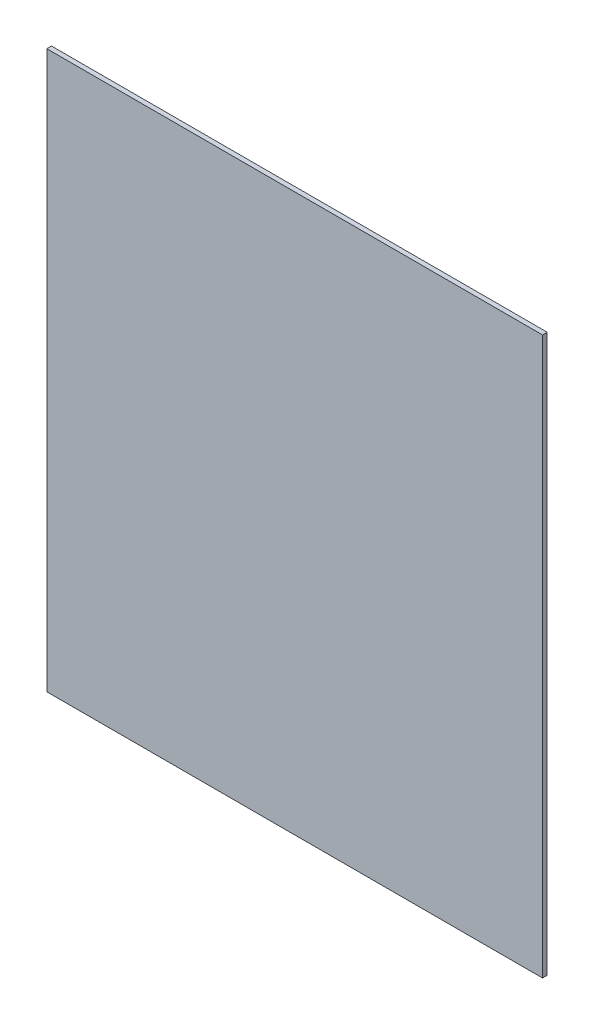
ISO-10303-21;
HEADER;
FILE_DESCRIPTION(('STEP AP214'),'2;1');
FILE_NAME('part.step','',(''),(''),'','','');
FILE_SCHEMA(('AUTOMOTIVE_DESIGN { 1 0 10303 214 1 1 1 1 }'));
ENDSEC;
DATA;
#1=APPLICATION_CONTEXT('core data for automotive mechanical design processes');
#2=APPLICATION_PROTOCOL_DEFINITION('international standard','automotive_design',2000,#1);
#3=PRODUCT_CONTEXT('',#1,'mechanical');
#4=PRODUCT('Part','Part','',(#3));
#5=PRODUCT_RELATED_PRODUCT_CATEGORY('part','',(#4));
#6=PRODUCT_DEFINITION_FORMATION('','',#4);
#7=PRODUCT_DEFINITION_CONTEXT('part definition',#1,'design');
#8=PRODUCT_DEFINITION('design','',#6,#7);
#9=PRODUCT_DEFINITION_SHAPE('','',#8);
#10=(LENGTH_UNIT() NAMED_UNIT(*) SI_UNIT(.MILLI.,.METRE.));
#11=(NAMED_UNIT(*) PLANE_ANGLE_UNIT() SI_UNIT($,.RADIAN.));
#12=(NAMED_UNIT(*) SI_UNIT($,.STERADIAN.) SOLID_ANGLE_UNIT());
#13=UNCERTAINTY_MEASURE_WITH_UNIT(LENGTH_MEASURE(1.E-05),#10,'distance_accuracy_value','');
#14=(GEOMETRIC_REPRESENTATION_CONTEXT(3) GLOBAL_UNCERTAINTY_ASSIGNED_CONTEXT((#13)) GLOBAL_UNIT_ASSIGNED_CONTEXT((#10,
#11,#12)) REPRESENTATION_CONTEXT('',''));
#15=CARTESIAN_POINT('',(0.,0.,0.));
#16=DIRECTION('',(0.,0.,1.));
#17=DIRECTION('',(1.,0.,0.));
#18=AXIS2_PLACEMENT_3D('',#15,#16,#17);
#19=CARTESIAN_POINT('',(-64.29375,-72.23125,1.21412));
#20=DIRECTION('',(-1.,0.,0.));
#21=DIRECTION('',(0.,0.,1.));
#22=AXIS2_PLACEMENT_3D('',#19,#20,#21);
#23=PLANE('',#22);
#24=DIRECTION('',(0.,1.,0.));
#25=VECTOR('',#24,1.);
#26=CARTESIAN_POINT('',(-64.29375,-72.23125,0.));
#27=LINE('',#26,#25);
#28=CARTESIAN_POINT('',(-64.29375,-72.23125,0.));
#29=VERTEX_POINT('',#28);
#30=CARTESIAN_POINT('',(-64.29375,72.23125,0.));
#31=VERTEX_POINT('',#30);
#32=EDGE_CURVE('E114',#29,#31,#27,.T.);
#33=ORIENTED_EDGE('',*,*,#32,.F.);
#34=DIRECTION('',(0.,0.,-1.));
#35=VECTOR('',#34,1.);
#36=CARTESIAN_POINT('',(-64.29375,-72.23125,1.21412));
#37=LINE('',#36,#35);
#38=CARTESIAN_POINT('',(-64.29375,-72.23125,1.21412));
#39=VERTEX_POINT('',#38);
#40=EDGE_CURVE('E11',#39,#29,#37,.T.);
#41=ORIENTED_EDGE('',*,*,#40,.F.);
#42=DIRECTION('',(0.,1.,0.));
#43=VECTOR('',#42,1.);
#44=CARTESIAN_POINT('',(-64.29375,-72.23125,1.21412));
#45=LINE('',#44,#43);
#46=CARTESIAN_POINT('',(-64.29375,72.23125,1.21412));
#47=VERTEX_POINT('',#46);
#48=EDGE_CURVE('E107',#39,#47,#45,.T.);
#49=ORIENTED_EDGE('',*,*,#48,.T.);
#50=DIRECTION('',(0.,0.,-1.));
#51=VECTOR('',#50,1.);
#52=CARTESIAN_POINT('',(-64.29375,72.23125,1.21412));
#53=LINE('',#52,#51);
#54=EDGE_CURVE('E46',#47,#31,#53,.T.);
#55=ORIENTED_EDGE('',*,*,#54,.T.);
#56=EDGE_LOOP('',(#33,#41,#49,#55));
#57=FACE_BOUND('',#56,.T.);
#58=ADVANCED_FACE('F43',(#57),#23,.T.);
#59=CARTESIAN_POINT('',(-64.29375,-72.23125,1.21412));
#60=DIRECTION('',(0.,1.,0.));
#61=DIRECTION('',(0.,0.,1.));
#62=AXIS2_PLACEMENT_3D('',#59,#60,#61);
#63=PLANE('',#62);
#64=DIRECTION('',(1.,0.,0.));
#65=VECTOR('',#64,1.);
#66=CARTESIAN_POINT('',(-64.29375,-72.23125,0.));
#67=LINE('',#66,#65);
#68=CARTESIAN_POINT('',(64.29375,-72.23125,0.));
#69=VERTEX_POINT('',#68);
#70=EDGE_CURVE('E77',#29,#69,#67,.T.);
#71=ORIENTED_EDGE('',*,*,#70,.T.);
#72=DIRECTION('',(0.,0.,-1.));
#73=VECTOR('',#72,1.);
#74=CARTESIAN_POINT('',(64.29375,-72.23125,1.21412));
#75=LINE('',#74,#73);
#76=CARTESIAN_POINT('',(64.29375,-72.23125,1.21412));
#77=VERTEX_POINT('',#76);
#78=EDGE_CURVE('E53',#77,#69,#75,.T.);
#79=ORIENTED_EDGE('',*,*,#78,.F.);
#80=DIRECTION('',(1.,0.,0.));
#81=VECTOR('',#80,1.);
#82=CARTESIAN_POINT('',(-64.29375,-72.23125,1.21412));
#83=LINE('',#82,#81);
#84=EDGE_CURVE('E94',#39,#77,#83,.T.);
#85=ORIENTED_EDGE('',*,*,#84,.F.);
#86=ORIENTED_EDGE('',*,*,#40,.T.);
#87=EDGE_LOOP('',(#71,#79,#85,#86));
#88=FACE_BOUND('',#87,.T.);
#89=ADVANCED_FACE('F130',(#88),#63,.F.);
#90=CARTESIAN_POINT('',(64.29375,-72.23125,1.21412));
#91=DIRECTION('',(-1.,0.,0.));
#92=DIRECTION('',(0.,0.,1.));
#93=AXIS2_PLACEMENT_3D('',#90,#91,#92);
#94=PLANE('',#93);
#95=DIRECTION('',(0.,1.,0.));
#96=VECTOR('',#95,1.);
#97=CARTESIAN_POINT('',(64.29375,-72.23125,0.));
#98=LINE('',#97,#96);
#99=CARTESIAN_POINT('',(64.29375,72.23125,0.));
#100=VERTEX_POINT('',#99);
#101=EDGE_CURVE('E102',#69,#100,#98,.T.);
#102=ORIENTED_EDGE('',*,*,#101,.T.);
#103=DIRECTION('',(0.,0.,-1.));
#104=VECTOR('',#103,1.);
#105=CARTESIAN_POINT('',(64.29375,72.23125,1.21412));
#106=LINE('',#105,#104);
#107=CARTESIAN_POINT('',(64.29375,72.23125,1.21412));
#108=VERTEX_POINT('',#107);
#109=EDGE_CURVE('E99',#108,#100,#106,.T.);
#110=ORIENTED_EDGE('',*,*,#109,.F.);
#111=DIRECTION('',(0.,1.,0.));
#112=VECTOR('',#111,1.);
#113=CARTESIAN_POINT('',(64.29375,-72.23125,1.21412));
#114=LINE('',#113,#112);
#115=EDGE_CURVE('E89',#77,#108,#114,.T.);
#116=ORIENTED_EDGE('',*,*,#115,.F.);
#117=ORIENTED_EDGE('',*,*,#78,.T.);
#118=EDGE_LOOP('',(#102,#110,#116,#117));
#119=FACE_BOUND('',#118,.T.);
#120=ADVANCED_FACE('F100',(#119),#94,.F.);
#121=CARTESIAN_POINT('',(-64.29375,72.23125,1.21412));
#122=DIRECTION('',(0.,1.,0.));
#123=DIRECTION('',(0.,0.,1.));
#124=AXIS2_PLACEMENT_3D('',#121,#122,#123);
#125=PLANE('',#124);
#126=DIRECTION('',(1.,0.,0.));
#127=VECTOR('',#126,1.);
#128=CARTESIAN_POINT('',(-64.29375,72.23125,0.));
#129=LINE('',#128,#127);
#130=EDGE_CURVE('E118',#31,#100,#129,.T.);
#131=ORIENTED_EDGE('',*,*,#130,.F.);
#132=ORIENTED_EDGE('',*,*,#54,.F.);
#133=DIRECTION('',(1.,0.,0.));
#134=VECTOR('',#133,1.);
#135=CARTESIAN_POINT('',(-64.29375,72.23125,1.21412));
#136=LINE('',#135,#134);
#137=EDGE_CURVE('E93',#47,#108,#136,.T.);
#138=ORIENTED_EDGE('',*,*,#137,.T.);
#139=ORIENTED_EDGE('',*,*,#109,.T.);
#140=EDGE_LOOP('',(#131,#132,#138,#139));
#141=FACE_BOUND('',#140,.T.);
#142=ADVANCED_FACE('F105',(#141),#125,.T.);
#143=CARTESIAN_POINT('',(0.,0.,1.21412));
#144=DIRECTION('',(0.,0.,-1.));
#145=DIRECTION('',(-1.,0.,0.));
#146=AXIS2_PLACEMENT_3D('',#143,#144,#145);
#147=PLANE('',#146);
#148=ORIENTED_EDGE('',*,*,#48,.F.);
#149=ORIENTED_EDGE('',*,*,#84,.T.);
#150=ORIENTED_EDGE('',*,*,#115,.T.);
#151=ORIENTED_EDGE('',*,*,#137,.F.);
#152=EDGE_LOOP('',(#148,#149,#150,#151));
#153=FACE_BOUND('',#152,.T.);
#154=ADVANCED_FACE('F92',(#153),#147,.F.);
#155=CARTESIAN_POINT('',(0.,0.,0.));
#156=DIRECTION('',(0.,0.,-1.));
#157=DIRECTION('',(-1.,0.,0.));
#158=AXIS2_PLACEMENT_3D('',#155,#156,#157);
#159=PLANE('',#158);
#160=ORIENTED_EDGE('',*,*,#32,.T.);
#161=ORIENTED_EDGE('',*,*,#130,.T.);
#162=ORIENTED_EDGE('',*,*,#101,.F.);
#163=ORIENTED_EDGE('',*,*,#70,.F.);
#164=EDGE_LOOP('',(#160,#161,#162,#163));
#165=FACE_BOUND('',#164,.T.);
#166=ADVANCED_FACE('F127',(#165),#159,.T.);
#167=CLOSED_SHELL('',(#58,#89,#120,#142,#154,#166));
#168=MANIFOLD_SOLID_BREP('B2',#167);
#169=ADVANCED_BREP_SHAPE_REPRESENTATION('',(#18,#168),#14);
#170=SHAPE_DEFINITION_REPRESENTATION(#9,#169);
ENDSEC;
END-ISO-10303-21;
